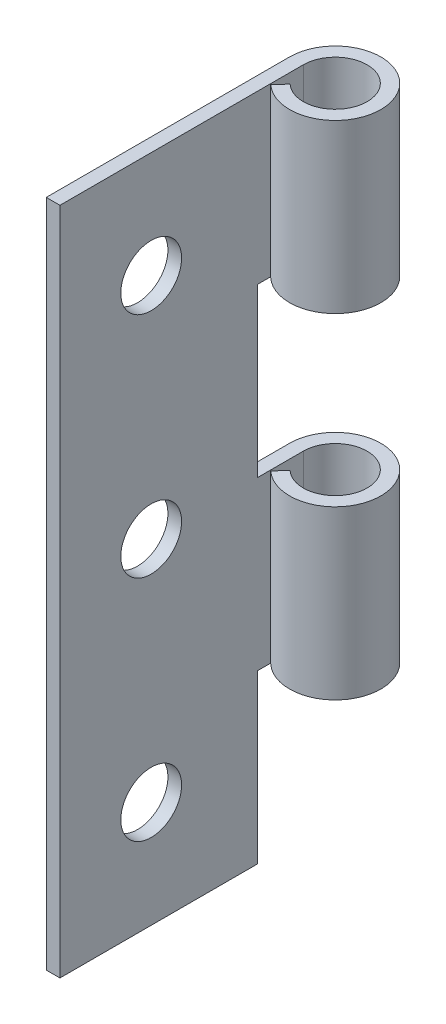
ISO-10303-21;
HEADER;
FILE_DESCRIPTION(('STEP AP214'),'2;1');
FILE_NAME('part.step','',(''),(''),'','','');
FILE_SCHEMA(('AUTOMOTIVE_DESIGN { 1 0 10303 214 1 1 1 1 }'));
ENDSEC;
DATA;
#1=APPLICATION_CONTEXT('core data for automotive mechanical design processes');
#2=APPLICATION_PROTOCOL_DEFINITION('international standard','automotive_design',2000,#1);
#3=PRODUCT_CONTEXT('',#1,'mechanical');
#4=PRODUCT('Part','Part','',(#3));
#5=PRODUCT_RELATED_PRODUCT_CATEGORY('part','',(#4));
#6=PRODUCT_DEFINITION_FORMATION('','',#4);
#7=PRODUCT_DEFINITION_CONTEXT('part definition',#1,'design');
#8=PRODUCT_DEFINITION('design','',#6,#7);
#9=PRODUCT_DEFINITION_SHAPE('','',#8);
#10=(LENGTH_UNIT() NAMED_UNIT(*) SI_UNIT(.MILLI.,.METRE.));
#11=(NAMED_UNIT(*) PLANE_ANGLE_UNIT() SI_UNIT($,.RADIAN.));
#12=(NAMED_UNIT(*) SI_UNIT($,.STERADIAN.) SOLID_ANGLE_UNIT());
#13=UNCERTAINTY_MEASURE_WITH_UNIT(LENGTH_MEASURE(1.E-05),#10,'distance_accuracy_value','');
#14=(GEOMETRIC_REPRESENTATION_CONTEXT(3) GLOBAL_UNCERTAINTY_ASSIGNED_CONTEXT((#13)) GLOBAL_UNIT_ASSIGNED_CONTEXT((#10,
#11,#12)) REPRESENTATION_CONTEXT('',''));
#15=CARTESIAN_POINT('',(0.,0.,0.));
#16=DIRECTION('',(0.,0.,1.));
#17=DIRECTION('',(1.,0.,0.));
#18=AXIS2_PLACEMENT_3D('',#15,#16,#17);
#19=CARTESIAN_POINT('',(2.99999999997169,44.,-15.9999999999911));
#20=DIRECTION('',(0.,-1.,0.));
#21=DIRECTION('',(0.,0.,-1.));
#22=AXIS2_PLACEMENT_3D('',#19,#20,#21);
#23=CYLINDRICAL_SURFACE('',#22,2.99999999997169);
#24=DIRECTION('',(0.,-1.,0.));
#25=VECTOR('',#24,1.);
#26=CARTESIAN_POINT('',(0.954983966023311,44.,-13.8050263280023));
#27=LINE('',#26,#25);
#28=CARTESIAN_POINT('',(0.954983966023311,44.,-13.8050263280023));
#29=VERTEX_POINT('',#28);
#30=CARTESIAN_POINT('',(0.954983966023311,33.,-13.8050263280023));
#31=VERTEX_POINT('',#30);
#32=EDGE_CURVE('E206',#29,#31,#27,.T.);
#33=ORIENTED_EDGE('',*,*,#32,.T.);
#34=CARTESIAN_POINT('',(2.99999999997169,33.,-15.9999999999911));
#35=DIRECTION('',(0.,1.,0.));
#36=DIRECTION('',(0.,0.,1.));
#37=AXIS2_PLACEMENT_3D('',#34,#35,#36);
#38=CIRCLE('',#37,2.99999999997169);
#39=CARTESIAN_POINT('',(0.,33.,-15.9999999999911));
#40=VERTEX_POINT('',#39);
#41=EDGE_CURVE('E246',#40,#31,#38,.F.);
#42=ORIENTED_EDGE('',*,*,#41,.F.);
#43=DIRECTION('',(0.,-1.,0.));
#44=VECTOR('',#43,1.);
#45=CARTESIAN_POINT('',(0.,44.,-15.9999999999911));
#46=LINE('',#45,#44);
#47=CARTESIAN_POINT('',(0.,44.,-15.9999999999911));
#48=VERTEX_POINT('',#47);
#49=EDGE_CURVE('E179',#48,#40,#46,.T.);
#50=ORIENTED_EDGE('',*,*,#49,.F.);
#51=CARTESIAN_POINT('',(2.99999999997169,44.,-15.9999999999911));
#52=DIRECTION('',(0.,-1.,0.));
#53=DIRECTION('',(0.,0.,-1.));
#54=AXIS2_PLACEMENT_3D('',#51,#52,#53);
#55=CIRCLE('',#54,2.99999999997169);
#56=EDGE_CURVE('E245',#48,#29,#55,.T.);
#57=ORIENTED_EDGE('',*,*,#56,.T.);
#58=EDGE_LOOP('',(#33,#42,#50,#57));
#59=FACE_BOUND('',#58,.T.);
#60=ADVANCED_FACE('F39',(#59),#23,.T.);
#61=CARTESIAN_POINT('',(2.99999999997169,44.,-15.9999999999911));
#62=DIRECTION('',(0.,-1.,0.));
#63=DIRECTION('',(0.,0.,-1.));
#64=AXIS2_PLACEMENT_3D('',#61,#62,#63);
#65=CYLINDRICAL_SURFACE('',#64,2.09999999997169);
#66=CARTESIAN_POINT('',(2.99999999997169,33.,-15.9999999999911));
#67=DIRECTION('',(0.,1.,0.));
#68=DIRECTION('',(0.,0.,1.));
#69=AXIS2_PLACEMENT_3D('',#66,#67,#68);
#70=CIRCLE('',#69,2.09999999997169);
#71=CARTESIAN_POINT('',(1.56848877621361,33.,-14.4635184296052));
#72=VERTEX_POINT('',#71);
#73=CARTESIAN_POINT('',(0.9,33.,-15.9999999999911));
#74=VERTEX_POINT('',#73);
#75=EDGE_CURVE('E299',#72,#74,#70,.T.);
#76=ORIENTED_EDGE('',*,*,#75,.F.);
#77=DIRECTION('',(0.,-1.,0.));
#78=VECTOR('',#77,1.);
#79=CARTESIAN_POINT('',(1.56848877621362,44.,-14.4635184296052));
#80=LINE('',#79,#78);
#81=CARTESIAN_POINT('',(1.56848877621362,44.,-14.4635184296052));
#82=VERTEX_POINT('',#81);
#83=EDGE_CURVE('E218',#82,#72,#80,.T.);
#84=ORIENTED_EDGE('',*,*,#83,.F.);
#85=CARTESIAN_POINT('',(2.99999999997169,44.,-15.9999999999911));
#86=DIRECTION('',(0.,1.,0.));
#87=DIRECTION('',(0.,0.,-1.));
#88=AXIS2_PLACEMENT_3D('',#85,#86,#87);
#89=CIRCLE('',#88,2.09999999997169);
#90=CARTESIAN_POINT('',(0.9,44.,-15.9999999999911));
#91=VERTEX_POINT('',#90);
#92=EDGE_CURVE('E207',#82,#91,#89,.T.);
#93=ORIENTED_EDGE('',*,*,#92,.T.);
#94=DIRECTION('',(0.,-1.,0.));
#95=VECTOR('',#94,1.);
#96=CARTESIAN_POINT('',(0.9,44.,-15.9999999999911));
#97=LINE('',#96,#95);
#98=EDGE_CURVE('E234',#91,#74,#97,.T.);
#99=ORIENTED_EDGE('',*,*,#98,.T.);
#100=EDGE_LOOP('',(#76,#84,#93,#99));
#101=FACE_BOUND('',#100,.T.);
#102=ADVANCED_FACE('F340',(#101),#65,.F.);
#103=CARTESIAN_POINT('',(1.56848877621361,44.,-14.4635184296052));
#104=DIRECTION('',(-0.731657890669852,0.,-0.68167201132256));
#105=DIRECTION('',(-0.68167201132256,0.,0.731657890669851));
#106=AXIS2_PLACEMENT_3D('',#103,#104,#105);
#107=PLANE('',#106);
#108=DIRECTION('',(0.68167201132256,0.,-0.731657890669851));
#109=VECTOR('',#108,1.);
#110=CARTESIAN_POINT('',(1.56848877621361,33.,-14.4635184296052));
#111=LINE('',#110,#109);
#112=EDGE_CURVE('E11',#31,#72,#111,.T.);
#113=ORIENTED_EDGE('',*,*,#112,.F.);
#114=ORIENTED_EDGE('',*,*,#32,.F.);
#115=DIRECTION('',(0.68167201132256,0.,-0.731657890669852));
#116=VECTOR('',#115,1.);
#117=CARTESIAN_POINT('',(1.56848877621361,44.,-14.4635184296052));
#118=LINE('',#117,#116);
#119=EDGE_CURVE('E214',#29,#82,#118,.T.);
#120=ORIENTED_EDGE('',*,*,#119,.T.);
#121=ORIENTED_EDGE('',*,*,#83,.T.);
#122=EDGE_LOOP('',(#113,#114,#120,#121));
#123=FACE_BOUND('',#122,.T.);
#124=ADVANCED_FACE('F346',(#123),#107,.T.);
#125=CARTESIAN_POINT('',(0.9,0.,0.));
#126=DIRECTION('',(0.,0.,-1.));
#127=DIRECTION('',(-1.,0.,0.));
#128=AXIS2_PLACEMENT_3D('',#125,#126,#127);
#129=PLANE('',#128);
#130=DIRECTION('',(0.,-1.,0.));
#131=VECTOR('',#130,1.);
#132=CARTESIAN_POINT('',(0.,0.,0.));
#133=LINE('',#132,#131);
#134=CARTESIAN_POINT('',(0.,44.,0.));
#135=VERTEX_POINT('',#134);
#136=CARTESIAN_POINT('',(0.,0.,0.));
#137=VERTEX_POINT('',#136);
#138=EDGE_CURVE('E173',#135,#137,#133,.T.);
#139=ORIENTED_EDGE('',*,*,#138,.T.);
#140=DIRECTION('',(-1.,0.,0.));
#141=VECTOR('',#140,1.);
#142=CARTESIAN_POINT('',(0.9,0.,0.));
#143=LINE('',#142,#141);
#144=CARTESIAN_POINT('',(0.9,0.,0.));
#145=VERTEX_POINT('',#144);
#146=EDGE_CURVE('E169',#145,#137,#143,.T.);
#147=ORIENTED_EDGE('',*,*,#146,.F.);
#148=DIRECTION('',(0.,-1.,0.));
#149=VECTOR('',#148,1.);
#150=CARTESIAN_POINT('',(0.9,0.,0.));
#151=LINE('',#150,#149);
#152=CARTESIAN_POINT('',(0.9,44.,0.));
#153=VERTEX_POINT('',#152);
#154=EDGE_CURVE('E177',#153,#145,#151,.T.);
#155=ORIENTED_EDGE('',*,*,#154,.F.);
#156=DIRECTION('',(-1.,0.,0.));
#157=VECTOR('',#156,1.);
#158=CARTESIAN_POINT('',(0.9,44.,0.));
#159=LINE('',#158,#157);
#160=EDGE_CURVE('E183',#153,#135,#159,.T.);
#161=ORIENTED_EDGE('',*,*,#160,.T.);
#162=EDGE_LOOP('',(#139,#147,#155,#161));
#163=FACE_BOUND('',#162,.T.);
#164=ADVANCED_FACE('F41',(#163),#129,.F.);
#165=CARTESIAN_POINT('',(0.9,0.,0.));
#166=DIRECTION('',(0.,1.,0.));
#167=DIRECTION('',(0.,0.,1.));
#168=AXIS2_PLACEMENT_3D('',#165,#166,#167);
#169=PLANE('',#168);
#170=DIRECTION('',(0.,0.,-1.));
#171=VECTOR('',#170,1.);
#172=CARTESIAN_POINT('',(0.,0.,0.));
#173=LINE('',#172,#171);
#174=CARTESIAN_POINT('',(0.,0.,-13.0000000000194));
#175=VERTEX_POINT('',#174);
#176=EDGE_CURVE('E161',#137,#175,#173,.T.);
#177=ORIENTED_EDGE('',*,*,#176,.T.);
#178=DIRECTION('',(-1.,0.,0.));
#179=VECTOR('',#178,1.);
#180=CARTESIAN_POINT('',(127.,0.,-13.0000000000194));
#181=LINE('',#180,#179);
#182=CARTESIAN_POINT('',(0.900000000000012,0.,-13.0000000000194));
#183=VERTEX_POINT('',#182);
#184=EDGE_CURVE('E141',#183,#175,#181,.T.);
#185=ORIENTED_EDGE('',*,*,#184,.F.);
#186=DIRECTION('',(0.,0.,-1.));
#187=VECTOR('',#186,1.);
#188=CARTESIAN_POINT('',(0.9,0.,0.));
#189=LINE('',#188,#187);
#190=EDGE_CURVE('E223',#145,#183,#189,.T.);
#191=ORIENTED_EDGE('',*,*,#190,.F.);
#192=ORIENTED_EDGE('',*,*,#146,.T.);
#193=EDGE_LOOP('',(#177,#185,#191,#192));
#194=FACE_BOUND('',#193,.T.);
#195=ADVANCED_FACE('F167',(#194),#169,.F.);
#196=CARTESIAN_POINT('',(0.9,44.,0.));
#197=DIRECTION('',(0.,-1.,0.));
#198=DIRECTION('',(0.,0.,-1.));
#199=AXIS2_PLACEMENT_3D('',#196,#197,#198);
#200=PLANE('',#199);
#201=DIRECTION('',(0.,0.,1.));
#202=VECTOR('',#201,1.);
#203=CARTESIAN_POINT('',(0.,44.,0.));
#204=LINE('',#203,#202);
#205=EDGE_CURVE('E172',#48,#135,#204,.T.);
#206=ORIENTED_EDGE('',*,*,#205,.T.);
#207=ORIENTED_EDGE('',*,*,#160,.F.);
#208=DIRECTION('',(0.,0.,1.));
#209=VECTOR('',#208,1.);
#210=CARTESIAN_POINT('',(0.9,44.,0.));
#211=LINE('',#210,#209);
#212=EDGE_CURVE('E187',#91,#153,#211,.T.);
#213=ORIENTED_EDGE('',*,*,#212,.F.);
#214=ORIENTED_EDGE('',*,*,#92,.F.);
#215=ORIENTED_EDGE('',*,*,#119,.F.);
#216=ORIENTED_EDGE('',*,*,#56,.F.);
#217=EDGE_LOOP('',(#206,#207,#213,#214,#215,#216));
#218=FACE_BOUND('',#217,.T.);
#219=ADVANCED_FACE('F237',(#218),#200,.F.);
#220=CARTESIAN_POINT('',(0.9,0.,0.));
#221=DIRECTION('',(-1.,0.,0.));
#222=DIRECTION('',(0.,0.,1.));
#223=AXIS2_PLACEMENT_3D('',#220,#221,#222);
#224=PLANE('',#223);
#225=CARTESIAN_POINT('',(0.900000000000012,37.0000000000031,-5.99999999999568));
#226=DIRECTION('',(-1.,0.,0.));
#227=DIRECTION('',(0.,0.,1.));
#228=AXIS2_PLACEMENT_3D('',#225,#226,#227);
#229=CIRCLE('',#228,2.);
#230=CARTESIAN_POINT('',(0.900000000000012,37.0000000000031,-3.99999999999568));
#231=VERTEX_POINT('',#230);
#232=EDGE_CURVE('E253',#231,#231,#229,.T.);
#233=ORIENTED_EDGE('',*,*,#232,.T.);
#234=EDGE_LOOP('',(#233));
#235=FACE_BOUND('',#234,.T.);
#236=CARTESIAN_POINT('',(0.900000000000012,21.9999999999957,-5.99999999999568));
#237=DIRECTION('',(-1.,0.,0.));
#238=DIRECTION('',(0.,0.,1.));
#239=AXIS2_PLACEMENT_3D('',#236,#237,#238);
#240=CIRCLE('',#239,2.);
#241=CARTESIAN_POINT('',(0.900000000000012,21.9999999999957,-3.99999999999568));
#242=VERTEX_POINT('',#241);
#243=EDGE_CURVE('E259',#242,#242,#240,.T.);
#244=ORIENTED_EDGE('',*,*,#243,.T.);
#245=EDGE_LOOP('',(#244));
#246=FACE_BOUND('',#245,.T.);
#247=CARTESIAN_POINT('',(0.900000000000012,7.0000000000025,-5.99999999999568));
#248=DIRECTION('',(-1.,0.,0.));
#249=DIRECTION('',(0.,0.,1.));
#250=AXIS2_PLACEMENT_3D('',#247,#248,#249);
#251=CIRCLE('',#250,2.);
#252=CARTESIAN_POINT('',(0.900000000000012,7.0000000000025,-3.99999999999568));
#253=VERTEX_POINT('',#252);
#254=EDGE_CURVE('E315',#253,#253,#251,.T.);
#255=ORIENTED_EDGE('',*,*,#254,.T.);
#256=EDGE_LOOP('',(#255));
#257=FACE_BOUND('',#256,.T.);
#258=DIRECTION('',(0.,1.,0.));
#259=VECTOR('',#258,1.);
#260=CARTESIAN_POINT('',(0.9,0.,-13.0000000000194));
#261=LINE('',#260,#259);
#262=CARTESIAN_POINT('',(0.900000000000012,22.,-13.0000000000194));
#263=VERTEX_POINT('',#262);
#264=CARTESIAN_POINT('',(0.900000000000012,33.,-13.0000000000194));
#265=VERTEX_POINT('',#264);
#266=EDGE_CURVE('E312',#263,#265,#261,.T.);
#267=ORIENTED_EDGE('',*,*,#266,.T.);
#268=DIRECTION('',(0.,0.,-1.));
#269=VECTOR('',#268,1.);
#270=CARTESIAN_POINT('',(0.9,33.,0.));
#271=LINE('',#270,#269);
#272=EDGE_CURVE('E305',#265,#74,#271,.T.);
#273=ORIENTED_EDGE('',*,*,#272,.T.);
#274=ORIENTED_EDGE('',*,*,#98,.F.);
#275=ORIENTED_EDGE('',*,*,#212,.T.);
#276=ORIENTED_EDGE('',*,*,#154,.T.);
#277=ORIENTED_EDGE('',*,*,#190,.T.);
#278=DIRECTION('',(0.,1.,0.));
#279=VECTOR('',#278,1.);
#280=CARTESIAN_POINT('',(0.9,0.,-13.0000000000194));
#281=LINE('',#280,#279);
#282=CARTESIAN_POINT('',(0.900000000000012,11.,-13.0000000000194));
#283=VERTEX_POINT('',#282);
#284=EDGE_CURVE('E148',#183,#283,#281,.T.);
#285=ORIENTED_EDGE('',*,*,#284,.T.);
#286=DIRECTION('',(0.,0.,-1.));
#287=VECTOR('',#286,1.);
#288=CARTESIAN_POINT('',(0.9,11.,0.));
#289=LINE('',#288,#287);
#290=CARTESIAN_POINT('',(0.9,11.,-15.9999999999911));
#291=VERTEX_POINT('',#290);
#292=EDGE_CURVE('E281',#283,#291,#289,.T.);
#293=ORIENTED_EDGE('',*,*,#292,.T.);
#294=CARTESIAN_POINT('',(0.9,22.,-15.9999999999911));
#295=VERTEX_POINT('',#294);
#296=EDGE_CURVE('E263',#295,#291,#97,.T.);
#297=ORIENTED_EDGE('',*,*,#296,.F.);
#298=DIRECTION('',(0.,0.,1.));
#299=VECTOR('',#298,1.);
#300=CARTESIAN_POINT('',(0.9,22.,0.));
#301=LINE('',#300,#299);
#302=EDGE_CURVE('E296',#295,#263,#301,.T.);
#303=ORIENTED_EDGE('',*,*,#302,.T.);
#304=EDGE_LOOP('',(#267,#273,#274,#275,#276,#277,#285,#293,#297,#303));
#305=FACE_BOUND('',#304,.T.);
#306=ADVANCED_FACE('F230',(#235,#246,#257,#305),#224,.F.);
#307=CARTESIAN_POINT('',(0.,0.,0.));
#308=DIRECTION('',(-1.,0.,0.));
#309=DIRECTION('',(0.,0.,1.));
#310=AXIS2_PLACEMENT_3D('',#307,#308,#309);
#311=PLANE('',#310);
#312=DIRECTION('',(0.,0.,-1.));
#313=VECTOR('',#312,1.);
#314=CARTESIAN_POINT('',(0.,33.,-18.9999999999628));
#315=LINE('',#314,#313);
#316=CARTESIAN_POINT('',(0.,33.,-13.0000000000194));
#317=VERTEX_POINT('',#316);
#318=EDGE_CURVE('E365',#317,#40,#315,.T.);
#319=ORIENTED_EDGE('',*,*,#318,.F.);
#320=DIRECTION('',(0.,1.,0.));
#321=VECTOR('',#320,1.);
#322=CARTESIAN_POINT('',(0.,22.,-13.0000000000194));
#323=LINE('',#322,#321);
#324=CARTESIAN_POINT('',(0.,22.,-13.0000000000194));
#325=VERTEX_POINT('',#324);
#326=EDGE_CURVE('E360',#325,#317,#323,.T.);
#327=ORIENTED_EDGE('',*,*,#326,.F.);
#328=DIRECTION('',(0.,0.,1.));
#329=VECTOR('',#328,1.);
#330=CARTESIAN_POINT('',(0.,22.,-18.9999999999628));
#331=LINE('',#330,#329);
#332=CARTESIAN_POINT('',(0.,22.,-15.9999999999911));
#333=VERTEX_POINT('',#332);
#334=EDGE_CURVE('E358',#333,#325,#331,.T.);
#335=ORIENTED_EDGE('',*,*,#334,.F.);
#336=CARTESIAN_POINT('',(0.,11.,-15.9999999999911));
#337=VERTEX_POINT('',#336);
#338=EDGE_CURVE('E248',#333,#337,#46,.T.);
#339=ORIENTED_EDGE('',*,*,#338,.T.);
#340=DIRECTION('',(0.,0.,-1.));
#341=VECTOR('',#340,1.);
#342=CARTESIAN_POINT('',(0.,11.,-18.9999999999628));
#343=LINE('',#342,#341);
#344=CARTESIAN_POINT('',(0.,11.,-13.0000000000194));
#345=VERTEX_POINT('',#344);
#346=EDGE_CURVE('E154',#345,#337,#343,.T.);
#347=ORIENTED_EDGE('',*,*,#346,.F.);
#348=DIRECTION('',(0.,1.,0.));
#349=VECTOR('',#348,1.);
#350=CARTESIAN_POINT('',(0.,0.,-13.0000000000194));
#351=LINE('',#350,#349);
#352=EDGE_CURVE('E145',#175,#345,#351,.T.);
#353=ORIENTED_EDGE('',*,*,#352,.F.);
#354=ORIENTED_EDGE('',*,*,#176,.F.);
#355=ORIENTED_EDGE('',*,*,#138,.F.);
#356=ORIENTED_EDGE('',*,*,#205,.F.);
#357=ORIENTED_EDGE('',*,*,#49,.T.);
#358=EDGE_LOOP('',(#319,#327,#335,#339,#347,#353,#354,#355,#356,#357));
#359=FACE_BOUND('',#358,.T.);
#360=CARTESIAN_POINT('',(0.,37.0000000000031,-5.99999999999568));
#361=DIRECTION('',(-1.,0.,0.));
#362=DIRECTION('',(0.,0.,1.));
#363=AXIS2_PLACEMENT_3D('',#360,#361,#362);
#364=CIRCLE('',#363,2.);
#365=CARTESIAN_POINT('',(0.,37.0000000000031,-3.99999999999568));
#366=VERTEX_POINT('',#365);
#367=EDGE_CURVE('E379',#366,#366,#364,.T.);
#368=ORIENTED_EDGE('',*,*,#367,.F.);
#369=EDGE_LOOP('',(#368));
#370=FACE_BOUND('',#369,.T.);
#371=CARTESIAN_POINT('',(0.,21.9999999999957,-5.99999999999568));
#372=DIRECTION('',(-1.,0.,0.));
#373=DIRECTION('',(0.,0.,1.));
#374=AXIS2_PLACEMENT_3D('',#371,#372,#373);
#375=CIRCLE('',#374,2.);
#376=CARTESIAN_POINT('',(0.,21.9999999999957,-3.99999999999568));
#377=VERTEX_POINT('',#376);
#378=EDGE_CURVE('E288',#377,#377,#375,.T.);
#379=ORIENTED_EDGE('',*,*,#378,.F.);
#380=EDGE_LOOP('',(#379));
#381=FACE_BOUND('',#380,.T.);
#382=CARTESIAN_POINT('',(0.,7.0000000000025,-5.99999999999568));
#383=DIRECTION('',(-1.,0.,0.));
#384=DIRECTION('',(0.,0.,1.));
#385=AXIS2_PLACEMENT_3D('',#382,#383,#384);
#386=CIRCLE('',#385,2.);
#387=CARTESIAN_POINT('',(0.,7.0000000000025,-3.99999999999568));
#388=VERTEX_POINT('',#387);
#389=EDGE_CURVE('E282',#388,#388,#386,.T.);
#390=ORIENTED_EDGE('',*,*,#389,.F.);
#391=EDGE_LOOP('',(#390));
#392=FACE_BOUND('',#391,.T.);
#393=ADVANCED_FACE('F158',(#359,#370,#381,#392),#311,.T.);
#394=CARTESIAN_POINT('',(2.99999999997169,22.,-15.9999999999911));
#395=DIRECTION('',(0.,-1.,0.));
#396=DIRECTION('',(0.,0.,-1.));
#397=AXIS2_PLACEMENT_3D('',#394,#395,#396);
#398=CIRCLE('',#397,2.99999999997169);
#399=CARTESIAN_POINT('',(0.954983966023311,22.,-13.8050263280023));
#400=VERTEX_POINT('',#399);
#401=EDGE_CURVE('E196',#400,#333,#398,.F.);
#402=ORIENTED_EDGE('',*,*,#401,.F.);
#403=CARTESIAN_POINT('',(0.954983966023311,11.,-13.8050263280023));
#404=VERTEX_POINT('',#403);
#405=EDGE_CURVE('E202',#400,#404,#27,.T.);
#406=ORIENTED_EDGE('',*,*,#405,.T.);
#407=CARTESIAN_POINT('',(2.99999999997169,11.,-15.9999999999911));
#408=DIRECTION('',(0.,1.,0.));
#409=DIRECTION('',(0.,0.,1.));
#410=AXIS2_PLACEMENT_3D('',#407,#408,#409);
#411=CIRCLE('',#410,2.99999999997169);
#412=EDGE_CURVE('E63',#337,#404,#411,.F.);
#413=ORIENTED_EDGE('',*,*,#412,.F.);
#414=ORIENTED_EDGE('',*,*,#338,.F.);
#415=EDGE_LOOP('',(#402,#406,#413,#414));
#416=FACE_BOUND('',#415,.T.);
#417=ADVANCED_FACE('F342',(#416),#23,.T.);
#418=CARTESIAN_POINT('',(2.99999999997169,22.,-15.9999999999911));
#419=DIRECTION('',(0.,-1.,0.));
#420=DIRECTION('',(0.,0.,-1.));
#421=AXIS2_PLACEMENT_3D('',#418,#419,#420);
#422=CIRCLE('',#421,2.09999999997169);
#423=CARTESIAN_POINT('',(1.56848877621362,22.,-14.4635184296052));
#424=VERTEX_POINT('',#423);
#425=EDGE_CURVE('E55',#295,#424,#422,.T.);
#426=ORIENTED_EDGE('',*,*,#425,.F.);
#427=ORIENTED_EDGE('',*,*,#296,.T.);
#428=CARTESIAN_POINT('',(2.99999999997169,11.,-15.9999999999911));
#429=DIRECTION('',(0.,1.,0.));
#430=DIRECTION('',(0.,0.,1.));
#431=AXIS2_PLACEMENT_3D('',#428,#429,#430);
#432=CIRCLE('',#431,2.09999999997169);
#433=CARTESIAN_POINT('',(1.56848877621361,11.,-14.4635184296052));
#434=VERTEX_POINT('',#433);
#435=EDGE_CURVE('E278',#434,#291,#432,.T.);
#436=ORIENTED_EDGE('',*,*,#435,.F.);
#437=EDGE_CURVE('E212',#424,#434,#80,.T.);
#438=ORIENTED_EDGE('',*,*,#437,.F.);
#439=EDGE_LOOP('',(#426,#427,#436,#438));
#440=FACE_BOUND('',#439,.T.);
#441=ADVANCED_FACE('F277',(#440),#65,.F.);
#442=DIRECTION('',(-0.68167201132256,0.,0.731657890669851));
#443=VECTOR('',#442,1.);
#444=CARTESIAN_POINT('',(1.56848877621361,22.,-14.4635184296052));
#445=LINE('',#444,#443);
#446=EDGE_CURVE('E48',#424,#400,#445,.T.);
#447=ORIENTED_EDGE('',*,*,#446,.F.);
#448=ORIENTED_EDGE('',*,*,#437,.T.);
#449=DIRECTION('',(0.68167201132256,0.,-0.731657890669851));
#450=VECTOR('',#449,1.);
#451=CARTESIAN_POINT('',(1.56848877621361,11.,-14.4635184296052));
#452=LINE('',#451,#450);
#453=EDGE_CURVE('E190',#404,#434,#452,.T.);
#454=ORIENTED_EDGE('',*,*,#453,.F.);
#455=ORIENTED_EDGE('',*,*,#405,.F.);
#456=EDGE_LOOP('',(#447,#448,#454,#455));
#457=FACE_BOUND('',#456,.T.);
#458=ADVANCED_FACE('F203',(#457),#107,.T.);
#459=CARTESIAN_POINT('',(127.,0.,-13.0000000000194));
#460=DIRECTION('',(0.,0.,1.));
#461=DIRECTION('',(1.,0.,0.));
#462=AXIS2_PLACEMENT_3D('',#459,#460,#461);
#463=PLANE('',#462);
#464=ORIENTED_EDGE('',*,*,#184,.T.);
#465=ORIENTED_EDGE('',*,*,#352,.T.);
#466=DIRECTION('',(-1.,0.,0.));
#467=VECTOR('',#466,1.);
#468=CARTESIAN_POINT('',(127.,11.,-13.0000000000194));
#469=LINE('',#468,#467);
#470=EDGE_CURVE('E153',#283,#345,#469,.T.);
#471=ORIENTED_EDGE('',*,*,#470,.F.);
#472=ORIENTED_EDGE('',*,*,#284,.F.);
#473=EDGE_LOOP('',(#464,#465,#471,#472));
#474=FACE_BOUND('',#473,.T.);
#475=ADVANCED_FACE('F143',(#474),#463,.F.);
#476=CARTESIAN_POINT('',(127.,11.,-18.9999999999628));
#477=DIRECTION('',(0.,1.,0.));
#478=DIRECTION('',(0.,0.,1.));
#479=AXIS2_PLACEMENT_3D('',#476,#477,#478);
#480=PLANE('',#479);
#481=ORIENTED_EDGE('',*,*,#412,.T.);
#482=ORIENTED_EDGE('',*,*,#453,.T.);
#483=ORIENTED_EDGE('',*,*,#435,.T.);
#484=ORIENTED_EDGE('',*,*,#292,.F.);
#485=ORIENTED_EDGE('',*,*,#470,.T.);
#486=ORIENTED_EDGE('',*,*,#346,.T.);
#487=EDGE_LOOP('',(#481,#482,#483,#484,#485,#486));
#488=FACE_BOUND('',#487,.T.);
#489=ADVANCED_FACE('F377',(#488),#480,.F.);
#490=CARTESIAN_POINT('',(127.,22.,-13.0000000000194));
#491=DIRECTION('',(0.,0.,1.));
#492=DIRECTION('',(1.,0.,0.));
#493=AXIS2_PLACEMENT_3D('',#490,#491,#492);
#494=PLANE('',#493);
#495=DIRECTION('',(-1.,0.,0.));
#496=VECTOR('',#495,1.);
#497=CARTESIAN_POINT('',(127.,22.,-13.0000000000194));
#498=LINE('',#497,#496);
#499=EDGE_CURVE('E371',#263,#325,#498,.T.);
#500=ORIENTED_EDGE('',*,*,#499,.T.);
#501=ORIENTED_EDGE('',*,*,#326,.T.);
#502=DIRECTION('',(-1.,0.,0.));
#503=VECTOR('',#502,1.);
#504=CARTESIAN_POINT('',(127.,33.,-13.0000000000194));
#505=LINE('',#504,#503);
#506=EDGE_CURVE('E165',#265,#317,#505,.T.);
#507=ORIENTED_EDGE('',*,*,#506,.F.);
#508=ORIENTED_EDGE('',*,*,#266,.F.);
#509=EDGE_LOOP('',(#500,#501,#507,#508));
#510=FACE_BOUND('',#509,.T.);
#511=ADVANCED_FACE('F375',(#510),#494,.F.);
#512=CARTESIAN_POINT('',(127.,33.,-18.9999999999628));
#513=DIRECTION('',(0.,1.,0.));
#514=DIRECTION('',(0.,0.,1.));
#515=AXIS2_PLACEMENT_3D('',#512,#513,#514);
#516=PLANE('',#515);
#517=ORIENTED_EDGE('',*,*,#41,.T.);
#518=ORIENTED_EDGE('',*,*,#112,.T.);
#519=ORIENTED_EDGE('',*,*,#75,.T.);
#520=ORIENTED_EDGE('',*,*,#272,.F.);
#521=ORIENTED_EDGE('',*,*,#506,.T.);
#522=ORIENTED_EDGE('',*,*,#318,.T.);
#523=EDGE_LOOP('',(#517,#518,#519,#520,#521,#522));
#524=FACE_BOUND('',#523,.T.);
#525=ADVANCED_FACE('F418',(#524),#516,.F.);
#526=CARTESIAN_POINT('',(127.,22.,-18.9999999999628));
#527=DIRECTION('',(0.,-1.,0.));
#528=DIRECTION('',(0.,0.,-1.));
#529=AXIS2_PLACEMENT_3D('',#526,#527,#528);
#530=PLANE('',#529);
#531=ORIENTED_EDGE('',*,*,#401,.T.);
#532=ORIENTED_EDGE('',*,*,#334,.T.);
#533=ORIENTED_EDGE('',*,*,#499,.F.);
#534=ORIENTED_EDGE('',*,*,#302,.F.);
#535=ORIENTED_EDGE('',*,*,#425,.T.);
#536=ORIENTED_EDGE('',*,*,#446,.T.);
#537=EDGE_LOOP('',(#531,#532,#533,#534,#535,#536));
#538=FACE_BOUND('',#537,.T.);
#539=ADVANCED_FACE('F194',(#538),#530,.F.);
#540=CARTESIAN_POINT('',(127.,7.0000000000025,-5.99999999999568));
#541=DIRECTION('',(-1.,0.,0.));
#542=DIRECTION('',(0.,0.,1.));
#543=AXIS2_PLACEMENT_3D('',#540,#541,#542);
#544=CYLINDRICAL_SURFACE('',#543,2.);
#545=ORIENTED_EDGE('',*,*,#389,.T.);
#546=EDGE_LOOP('',(#545));
#547=FACE_BOUND('',#546,.T.);
#548=ORIENTED_EDGE('',*,*,#254,.F.);
#549=EDGE_LOOP('',(#548));
#550=FACE_BOUND('',#549,.T.);
#551=ADVANCED_FACE('F327',(#547,#550),#544,.F.);
#552=CARTESIAN_POINT('',(127.,21.9999999999957,-5.99999999999568));
#553=DIRECTION('',(-1.,0.,0.));
#554=DIRECTION('',(0.,0.,1.));
#555=AXIS2_PLACEMENT_3D('',#552,#553,#554);
#556=CYLINDRICAL_SURFACE('',#555,2.);
#557=ORIENTED_EDGE('',*,*,#378,.T.);
#558=EDGE_LOOP('',(#557));
#559=FACE_BOUND('',#558,.T.);
#560=ORIENTED_EDGE('',*,*,#243,.F.);
#561=EDGE_LOOP('',(#560));
#562=FACE_BOUND('',#561,.T.);
#563=ADVANCED_FACE('F324',(#559,#562),#556,.F.);
#564=CARTESIAN_POINT('',(127.,37.0000000000031,-5.99999999999568));
#565=DIRECTION('',(-1.,0.,0.));
#566=DIRECTION('',(0.,0.,1.));
#567=AXIS2_PLACEMENT_3D('',#564,#565,#566);
#568=CYLINDRICAL_SURFACE('',#567,2.);
#569=ORIENTED_EDGE('',*,*,#367,.T.);
#570=EDGE_LOOP('',(#569));
#571=FACE_BOUND('',#570,.T.);
#572=ORIENTED_EDGE('',*,*,#232,.F.);
#573=EDGE_LOOP('',(#572));
#574=FACE_BOUND('',#573,.T.);
#575=ADVANCED_FACE('F326',(#571,#574),#568,.F.);
#576=CLOSED_SHELL('',(#60,#102,#124,#164,#195,#219,#306,#393,#417,#441,#458,#475,#489,#511,#525,
#539,#551,#563,#575));
#577=MANIFOLD_SOLID_BREP('B2',#576);
#578=ADVANCED_BREP_SHAPE_REPRESENTATION('',(#18,#577),#14);
#579=SHAPE_DEFINITION_REPRESENTATION(#9,#578);
ENDSEC;
END-ISO-10303-21;
